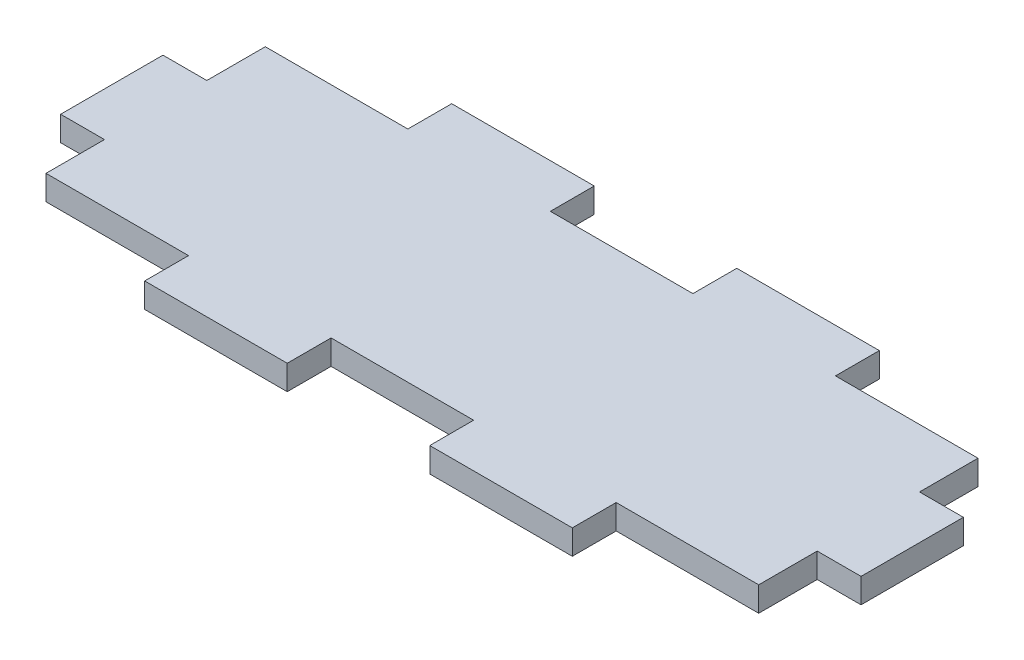
ISO-10303-21;
HEADER;
FILE_DESCRIPTION(('STEP AP214'),'2;1');
FILE_NAME('part.step','',(''),(''),'','','');
FILE_SCHEMA(('AUTOMOTIVE_DESIGN { 1 0 10303 214 1 1 1 1 }'));
ENDSEC;
DATA;
#1=APPLICATION_CONTEXT('core data for automotive mechanical design processes');
#2=APPLICATION_PROTOCOL_DEFINITION('international standard','automotive_design',2000,#1);
#3=PRODUCT_CONTEXT('',#1,'mechanical');
#4=PRODUCT('Part','Part','',(#3));
#5=PRODUCT_RELATED_PRODUCT_CATEGORY('part','',(#4));
#6=PRODUCT_DEFINITION_FORMATION('','',#4);
#7=PRODUCT_DEFINITION_CONTEXT('part definition',#1,'design');
#8=PRODUCT_DEFINITION('design','',#6,#7);
#9=PRODUCT_DEFINITION_SHAPE('','',#8);
#10=(LENGTH_UNIT() NAMED_UNIT(*) SI_UNIT(.MILLI.,.METRE.));
#11=(NAMED_UNIT(*) PLANE_ANGLE_UNIT() SI_UNIT($,.RADIAN.));
#12=(NAMED_UNIT(*) SI_UNIT($,.STERADIAN.) SOLID_ANGLE_UNIT());
#13=UNCERTAINTY_MEASURE_WITH_UNIT(LENGTH_MEASURE(1.E-05),#10,'distance_accuracy_value','');
#14=(GEOMETRIC_REPRESENTATION_CONTEXT(3) GLOBAL_UNCERTAINTY_ASSIGNED_CONTEXT((#13)) GLOBAL_UNIT_ASSIGNED_CONTEXT((#10,
#11,#12)) REPRESENTATION_CONTEXT('',''));
#15=CARTESIAN_POINT('',(0.,0.,0.));
#16=DIRECTION('',(0.,0.,1.));
#17=DIRECTION('',(1.,0.,0.));
#18=AXIS2_PLACEMENT_3D('',#15,#16,#17);
#19=CARTESIAN_POINT('',(0.,2.25,0.));
#20=DIRECTION('',(0.,0.,-1.));
#21=DIRECTION('',(-1.,0.,0.));
#22=AXIS2_PLACEMENT_3D('',#19,#20,#21);
#23=PLANE('',#22);
#24=DIRECTION('',(1.,0.,0.));
#25=VECTOR('',#24,1.);
#26=CARTESIAN_POINT('',(0.,0.,0.));
#27=LINE('',#26,#25);
#28=CARTESIAN_POINT('',(0.,0.,0.));
#29=VERTEX_POINT('',#28);
#30=CARTESIAN_POINT('',(13.,0.,0.));
#31=VERTEX_POINT('',#30);
#32=EDGE_CURVE('E259',#29,#31,#27,.T.);
#33=ORIENTED_EDGE('',*,*,#32,.T.);
#34=DIRECTION('',(0.,-1.,0.));
#35=VECTOR('',#34,1.);
#36=CARTESIAN_POINT('',(13.,2.25,0.));
#37=LINE('',#36,#35);
#38=CARTESIAN_POINT('',(13.,2.25,0.));
#39=VERTEX_POINT('',#38);
#40=EDGE_CURVE('E11',#39,#31,#37,.T.);
#41=ORIENTED_EDGE('',*,*,#40,.F.);
#42=DIRECTION('',(1.,0.,0.));
#43=VECTOR('',#42,1.);
#44=CARTESIAN_POINT('',(0.,2.25,0.));
#45=LINE('',#44,#43);
#46=CARTESIAN_POINT('',(0.,2.25,0.));
#47=VERTEX_POINT('',#46);
#48=EDGE_CURVE('E395',#47,#39,#45,.T.);
#49=ORIENTED_EDGE('',*,*,#48,.F.);
#50=DIRECTION('',(0.,-1.,0.));
#51=VECTOR('',#50,1.);
#52=CARTESIAN_POINT('',(0.,2.25,0.));
#53=LINE('',#52,#51);
#54=EDGE_CURVE('E56',#47,#29,#53,.T.);
#55=ORIENTED_EDGE('',*,*,#54,.T.);
#56=EDGE_LOOP('',(#33,#41,#49,#55));
#57=FACE_BOUND('',#56,.T.);
#58=ADVANCED_FACE('F39',(#57),#23,.F.);
#59=CARTESIAN_POINT('',(13.,2.25,0.));
#60=DIRECTION('',(1.,0.,0.));
#61=DIRECTION('',(0.,0.,-1.));
#62=AXIS2_PLACEMENT_3D('',#59,#60,#61);
#63=PLANE('',#62);
#64=DIRECTION('',(0.,0.,1.));
#65=VECTOR('',#64,1.);
#66=CARTESIAN_POINT('',(13.,0.,0.));
#67=LINE('',#66,#65);
#68=CARTESIAN_POINT('',(13.,0.,3.99999999999999));
#69=VERTEX_POINT('',#68);
#70=EDGE_CURVE('E261',#31,#69,#67,.T.);
#71=ORIENTED_EDGE('',*,*,#70,.T.);
#72=DIRECTION('',(0.,-1.,0.));
#73=VECTOR('',#72,1.);
#74=CARTESIAN_POINT('',(13.,2.25,3.99999999999999));
#75=LINE('',#74,#73);
#76=CARTESIAN_POINT('',(13.,2.25,3.99999999999999));
#77=VERTEX_POINT('',#76);
#78=EDGE_CURVE('E48',#77,#69,#75,.T.);
#79=ORIENTED_EDGE('',*,*,#78,.F.);
#80=DIRECTION('',(0.,0.,1.));
#81=VECTOR('',#80,1.);
#82=CARTESIAN_POINT('',(13.,2.25,0.));
#83=LINE('',#82,#81);
#84=EDGE_CURVE('E154',#39,#77,#83,.T.);
#85=ORIENTED_EDGE('',*,*,#84,.F.);
#86=ORIENTED_EDGE('',*,*,#40,.T.);
#87=EDGE_LOOP('',(#71,#79,#85,#86));
#88=FACE_BOUND('',#87,.T.);
#89=ADVANCED_FACE('F41',(#88),#63,.F.);
#90=CARTESIAN_POINT('',(0.,2.25,3.99999999999999));
#91=DIRECTION('',(0.,0.,-1.));
#92=DIRECTION('',(-1.,0.,0.));
#93=AXIS2_PLACEMENT_3D('',#90,#91,#92);
#94=PLANE('',#93);
#95=DIRECTION('',(1.,0.,0.));
#96=VECTOR('',#95,1.);
#97=CARTESIAN_POINT('',(0.,0.,3.99999999999999));
#98=LINE('',#97,#96);
#99=CARTESIAN_POINT('',(26.,0.,3.99999999999999));
#100=VERTEX_POINT('',#99);
#101=EDGE_CURVE('E265',#69,#100,#98,.T.);
#102=ORIENTED_EDGE('',*,*,#101,.T.);
#103=DIRECTION('',(0.,-1.,0.));
#104=VECTOR('',#103,1.);
#105=CARTESIAN_POINT('',(26.,2.25,3.99999999999999));
#106=LINE('',#105,#104);
#107=CARTESIAN_POINT('',(26.,2.25,3.99999999999999));
#108=VERTEX_POINT('',#107);
#109=EDGE_CURVE('E372',#108,#100,#106,.T.);
#110=ORIENTED_EDGE('',*,*,#109,.F.);
#111=DIRECTION('',(1.,0.,0.));
#112=VECTOR('',#111,1.);
#113=CARTESIAN_POINT('',(0.,2.25,3.99999999999999));
#114=LINE('',#113,#112);
#115=EDGE_CURVE('E379',#77,#108,#114,.T.);
#116=ORIENTED_EDGE('',*,*,#115,.F.);
#117=ORIENTED_EDGE('',*,*,#78,.T.);
#118=EDGE_LOOP('',(#102,#110,#116,#117));
#119=FACE_BOUND('',#118,.T.);
#120=ADVANCED_FACE('F377',(#119),#94,.F.);
#121=CARTESIAN_POINT('',(26.,2.25,0.));
#122=DIRECTION('',(1.,0.,0.));
#123=DIRECTION('',(0.,0.,-1.));
#124=AXIS2_PLACEMENT_3D('',#121,#122,#123);
#125=PLANE('',#124);
#126=DIRECTION('',(0.,0.,1.));
#127=VECTOR('',#126,1.);
#128=CARTESIAN_POINT('',(26.,0.,0.));
#129=LINE('',#128,#127);
#130=CARTESIAN_POINT('',(26.,0.,0.));
#131=VERTEX_POINT('',#130);
#132=EDGE_CURVE('E268',#131,#100,#129,.T.);
#133=ORIENTED_EDGE('',*,*,#132,.F.);
#134=DIRECTION('',(0.,-1.,0.));
#135=VECTOR('',#134,1.);
#136=CARTESIAN_POINT('',(26.,2.25,0.));
#137=LINE('',#136,#135);
#138=CARTESIAN_POINT('',(26.,2.25,0.));
#139=VERTEX_POINT('',#138);
#140=EDGE_CURVE('E370',#139,#131,#137,.T.);
#141=ORIENTED_EDGE('',*,*,#140,.F.);
#142=DIRECTION('',(0.,0.,1.));
#143=VECTOR('',#142,1.);
#144=CARTESIAN_POINT('',(26.,2.25,0.));
#145=LINE('',#144,#143);
#146=EDGE_CURVE('E390',#139,#108,#145,.T.);
#147=ORIENTED_EDGE('',*,*,#146,.T.);
#148=ORIENTED_EDGE('',*,*,#109,.T.);
#149=EDGE_LOOP('',(#133,#141,#147,#148));
#150=FACE_BOUND('',#149,.T.);
#151=ADVANCED_FACE('F386',(#150),#125,.T.);
#152=CARTESIAN_POINT('',(39.,0.,0.));
#153=VERTEX_POINT('',#152);
#154=EDGE_CURVE('E263',#131,#153,#27,.T.);
#155=ORIENTED_EDGE('',*,*,#154,.T.);
#156=DIRECTION('',(0.,-1.,0.));
#157=VECTOR('',#156,1.);
#158=CARTESIAN_POINT('',(39.,2.25,0.));
#159=LINE('',#158,#157);
#160=CARTESIAN_POINT('',(39.,2.25,0.));
#161=VERTEX_POINT('',#160);
#162=EDGE_CURVE('E367',#161,#153,#159,.T.);
#163=ORIENTED_EDGE('',*,*,#162,.F.);
#164=EDGE_CURVE('E391',#139,#161,#45,.T.);
#165=ORIENTED_EDGE('',*,*,#164,.F.);
#166=ORIENTED_EDGE('',*,*,#140,.T.);
#167=EDGE_LOOP('',(#155,#163,#165,#166));
#168=FACE_BOUND('',#167,.T.);
#169=ADVANCED_FACE('F484',(#168),#23,.F.);
#170=CARTESIAN_POINT('',(39.,2.25,0.));
#171=DIRECTION('',(1.,0.,0.));
#172=DIRECTION('',(0.,0.,-1.));
#173=AXIS2_PLACEMENT_3D('',#170,#171,#172);
#174=PLANE('',#173);
#175=DIRECTION('',(0.,0.,1.));
#176=VECTOR('',#175,1.);
#177=CARTESIAN_POINT('',(39.,0.,0.));
#178=LINE('',#177,#176);
#179=CARTESIAN_POINT('',(39.,0.,3.99999999999999));
#180=VERTEX_POINT('',#179);
#181=EDGE_CURVE('E271',#153,#180,#178,.T.);
#182=ORIENTED_EDGE('',*,*,#181,.T.);
#183=DIRECTION('',(0.,-1.,0.));
#184=VECTOR('',#183,1.);
#185=CARTESIAN_POINT('',(39.,2.25,3.99999999999999));
#186=LINE('',#185,#184);
#187=CARTESIAN_POINT('',(39.,2.25,3.99999999999999));
#188=VERTEX_POINT('',#187);
#189=EDGE_CURVE('E364',#188,#180,#186,.T.);
#190=ORIENTED_EDGE('',*,*,#189,.F.);
#191=DIRECTION('',(0.,0.,1.));
#192=VECTOR('',#191,1.);
#193=CARTESIAN_POINT('',(39.,2.25,0.));
#194=LINE('',#193,#192);
#195=EDGE_CURVE('E393',#161,#188,#194,.T.);
#196=ORIENTED_EDGE('',*,*,#195,.F.);
#197=ORIENTED_EDGE('',*,*,#162,.T.);
#198=EDGE_LOOP('',(#182,#190,#196,#197));
#199=FACE_BOUND('',#198,.T.);
#200=ADVANCED_FACE('F492',(#199),#174,.F.);
#201=CARTESIAN_POINT('',(0.,2.25,4.));
#202=DIRECTION('',(0.,0.,-1.));
#203=DIRECTION('',(-1.,0.,0.));
#204=AXIS2_PLACEMENT_3D('',#201,#202,#203);
#205=PLANE('',#204);
#206=DIRECTION('',(1.,0.,0.));
#207=VECTOR('',#206,1.);
#208=CARTESIAN_POINT('',(0.,0.,4.));
#209=LINE('',#208,#207);
#210=CARTESIAN_POINT('',(52.,0.,3.99999999999999));
#211=VERTEX_POINT('',#210);
#212=EDGE_CURVE('E273',#180,#211,#209,.T.);
#213=ORIENTED_EDGE('',*,*,#212,.T.);
#214=DIRECTION('',(0.,-1.,0.));
#215=VECTOR('',#214,1.);
#216=CARTESIAN_POINT('',(52.,2.25,3.99999999999999));
#217=LINE('',#216,#215);
#218=CARTESIAN_POINT('',(52.,2.25,3.99999999999999));
#219=VERTEX_POINT('',#218);
#220=EDGE_CURVE('E362',#219,#211,#217,.T.);
#221=ORIENTED_EDGE('',*,*,#220,.F.);
#222=DIRECTION('',(1.,0.,0.));
#223=VECTOR('',#222,1.);
#224=CARTESIAN_POINT('',(0.,2.25,4.));
#225=LINE('',#224,#223);
#226=EDGE_CURVE('E401',#188,#219,#225,.T.);
#227=ORIENTED_EDGE('',*,*,#226,.F.);
#228=ORIENTED_EDGE('',*,*,#189,.T.);
#229=EDGE_LOOP('',(#213,#221,#227,#228));
#230=FACE_BOUND('',#229,.T.);
#231=ADVANCED_FACE('F506',(#230),#205,.F.);
#232=CARTESIAN_POINT('',(52.,2.25,0.));
#233=DIRECTION('',(1.,0.,0.));
#234=DIRECTION('',(0.,0.,-1.));
#235=AXIS2_PLACEMENT_3D('',#232,#233,#234);
#236=PLANE('',#235);
#237=DIRECTION('',(0.,0.,1.));
#238=VECTOR('',#237,1.);
#239=CARTESIAN_POINT('',(52.,0.,0.));
#240=LINE('',#239,#238);
#241=CARTESIAN_POINT('',(52.,0.,0.));
#242=VERTEX_POINT('',#241);
#243=EDGE_CURVE('E276',#242,#211,#240,.T.);
#244=ORIENTED_EDGE('',*,*,#243,.F.);
#245=DIRECTION('',(0.,-1.,0.));
#246=VECTOR('',#245,1.);
#247=CARTESIAN_POINT('',(52.,2.25,0.));
#248=LINE('',#247,#246);
#249=CARTESIAN_POINT('',(52.,2.25,0.));
#250=VERTEX_POINT('',#249);
#251=EDGE_CURVE('E360',#250,#242,#248,.T.);
#252=ORIENTED_EDGE('',*,*,#251,.F.);
#253=DIRECTION('',(0.,0.,1.));
#254=VECTOR('',#253,1.);
#255=CARTESIAN_POINT('',(52.,2.25,0.));
#256=LINE('',#255,#254);
#257=EDGE_CURVE('E403',#250,#219,#256,.T.);
#258=ORIENTED_EDGE('',*,*,#257,.T.);
#259=ORIENTED_EDGE('',*,*,#220,.T.);
#260=EDGE_LOOP('',(#244,#252,#258,#259));
#261=FACE_BOUND('',#260,.T.);
#262=ADVANCED_FACE('F496',(#261),#236,.T.);
#263=CARTESIAN_POINT('',(65.,0.,0.));
#264=VERTEX_POINT('',#263);
#265=EDGE_CURVE('E262',#242,#264,#27,.T.);
#266=ORIENTED_EDGE('',*,*,#265,.T.);
#267=DIRECTION('',(0.,-1.,0.));
#268=VECTOR('',#267,1.);
#269=CARTESIAN_POINT('',(65.,2.25,0.));
#270=LINE('',#269,#268);
#271=CARTESIAN_POINT('',(65.,2.25,0.));
#272=VERTEX_POINT('',#271);
#273=EDGE_CURVE('E357',#272,#264,#270,.T.);
#274=ORIENTED_EDGE('',*,*,#273,.F.);
#275=EDGE_CURVE('E396',#250,#272,#45,.T.);
#276=ORIENTED_EDGE('',*,*,#275,.F.);
#277=ORIENTED_EDGE('',*,*,#251,.T.);
#278=EDGE_LOOP('',(#266,#274,#276,#277));
#279=FACE_BOUND('',#278,.T.);
#280=ADVANCED_FACE('F485',(#279),#23,.F.);
#281=CARTESIAN_POINT('',(65.,2.25,0.));
#282=DIRECTION('',(-1.,0.,0.));
#283=DIRECTION('',(0.,0.,1.));
#284=AXIS2_PLACEMENT_3D('',#281,#282,#283);
#285=PLANE('',#284);
#286=DIRECTION('',(0.,0.,-1.));
#287=VECTOR('',#286,1.);
#288=CARTESIAN_POINT('',(65.,0.,0.));
#289=LINE('',#288,#287);
#290=CARTESIAN_POINT('',(65.,0.,-5.33333333333334));
#291=VERTEX_POINT('',#290);
#292=EDGE_CURVE('E279',#264,#291,#289,.T.);
#293=ORIENTED_EDGE('',*,*,#292,.T.);
#294=DIRECTION('',(0.,-1.,0.));
#295=VECTOR('',#294,1.);
#296=CARTESIAN_POINT('',(65.,2.25,-5.33333333333334));
#297=LINE('',#296,#295);
#298=CARTESIAN_POINT('',(65.,2.25,-5.33333333333334));
#299=VERTEX_POINT('',#298);
#300=EDGE_CURVE('E354',#299,#291,#297,.T.);
#301=ORIENTED_EDGE('',*,*,#300,.F.);
#302=DIRECTION('',(0.,0.,-1.));
#303=VECTOR('',#302,1.);
#304=CARTESIAN_POINT('',(65.,2.25,0.));
#305=LINE('',#304,#303);
#306=EDGE_CURVE('E406',#272,#299,#305,.T.);
#307=ORIENTED_EDGE('',*,*,#306,.F.);
#308=ORIENTED_EDGE('',*,*,#273,.T.);
#309=EDGE_LOOP('',(#293,#301,#307,#308));
#310=FACE_BOUND('',#309,.T.);
#311=ADVANCED_FACE('F495',(#310),#285,.F.);
#312=CARTESIAN_POINT('',(0.,2.25,-5.33333333333336));
#313=DIRECTION('',(0.,0.,-1.));
#314=DIRECTION('',(-1.,0.,0.));
#315=AXIS2_PLACEMENT_3D('',#312,#313,#314);
#316=PLANE('',#315);
#317=DIRECTION('',(1.,0.,0.));
#318=VECTOR('',#317,1.);
#319=CARTESIAN_POINT('',(0.,0.,-5.33333333333336));
#320=LINE('',#319,#318);
#321=CARTESIAN_POINT('',(69.,0.,-5.33333333333333));
#322=VERTEX_POINT('',#321);
#323=EDGE_CURVE('E281',#291,#322,#320,.T.);
#324=ORIENTED_EDGE('',*,*,#323,.T.);
#325=DIRECTION('',(0.,-1.,0.));
#326=VECTOR('',#325,1.);
#327=CARTESIAN_POINT('',(69.,2.25,-5.33333333333333));
#328=LINE('',#327,#326);
#329=CARTESIAN_POINT('',(69.,2.25,-5.33333333333333));
#330=VERTEX_POINT('',#329);
#331=EDGE_CURVE('E352',#330,#322,#328,.T.);
#332=ORIENTED_EDGE('',*,*,#331,.F.);
#333=DIRECTION('',(1.,0.,0.));
#334=VECTOR('',#333,1.);
#335=CARTESIAN_POINT('',(0.,2.25,-5.33333333333336));
#336=LINE('',#335,#334);
#337=EDGE_CURVE('E408',#299,#330,#336,.T.);
#338=ORIENTED_EDGE('',*,*,#337,.F.);
#339=ORIENTED_EDGE('',*,*,#300,.T.);
#340=EDGE_LOOP('',(#324,#332,#338,#339));
#341=FACE_BOUND('',#340,.T.);
#342=ADVANCED_FACE('F502',(#341),#316,.F.);
#343=CARTESIAN_POINT('',(69.,2.25,0.));
#344=DIRECTION('',(1.,0.,0.));
#345=DIRECTION('',(0.,0.,-1.));
#346=AXIS2_PLACEMENT_3D('',#343,#344,#345);
#347=PLANE('',#346);
#348=DIRECTION('',(0.,0.,1.));
#349=VECTOR('',#348,1.);
#350=CARTESIAN_POINT('',(69.,0.,0.));
#351=LINE('',#350,#349);
#352=CARTESIAN_POINT('',(69.,0.,-14.6666666666667));
#353=VERTEX_POINT('',#352);
#354=EDGE_CURVE('E285',#353,#322,#351,.T.);
#355=ORIENTED_EDGE('',*,*,#354,.F.);
#356=DIRECTION('',(0.,-1.,0.));
#357=VECTOR('',#356,1.);
#358=CARTESIAN_POINT('',(69.,2.25,-14.6666666666667));
#359=LINE('',#358,#357);
#360=CARTESIAN_POINT('',(69.,2.25,-14.6666666666667));
#361=VERTEX_POINT('',#360);
#362=EDGE_CURVE('E350',#361,#353,#359,.T.);
#363=ORIENTED_EDGE('',*,*,#362,.F.);
#364=DIRECTION('',(0.,0.,1.));
#365=VECTOR('',#364,1.);
#366=CARTESIAN_POINT('',(69.,2.25,0.));
#367=LINE('',#366,#365);
#368=EDGE_CURVE('E411',#361,#330,#367,.T.);
#369=ORIENTED_EDGE('',*,*,#368,.T.);
#370=ORIENTED_EDGE('',*,*,#331,.T.);
#371=EDGE_LOOP('',(#355,#363,#369,#370));
#372=FACE_BOUND('',#371,.T.);
#373=ADVANCED_FACE('F572',(#372),#347,.T.);
#374=CARTESIAN_POINT('',(0.,2.25,-14.6666666666667));
#375=DIRECTION('',(0.,0.,-1.));
#376=DIRECTION('',(-1.,0.,0.));
#377=AXIS2_PLACEMENT_3D('',#374,#375,#376);
#378=PLANE('',#377);
#379=DIRECTION('',(1.,0.,0.));
#380=VECTOR('',#379,1.);
#381=CARTESIAN_POINT('',(0.,0.,-14.6666666666667));
#382=LINE('',#381,#380);
#383=CARTESIAN_POINT('',(65.,0.,-14.6666666666667));
#384=VERTEX_POINT('',#383);
#385=EDGE_CURVE('E288',#384,#353,#382,.T.);
#386=ORIENTED_EDGE('',*,*,#385,.F.);
#387=DIRECTION('',(0.,-1.,0.));
#388=VECTOR('',#387,1.);
#389=CARTESIAN_POINT('',(65.,2.25,-14.6666666666667));
#390=LINE('',#389,#388);
#391=CARTESIAN_POINT('',(65.,2.25,-14.6666666666667));
#392=VERTEX_POINT('',#391);
#393=EDGE_CURVE('E348',#392,#384,#390,.T.);
#394=ORIENTED_EDGE('',*,*,#393,.F.);
#395=DIRECTION('',(1.,0.,0.));
#396=VECTOR('',#395,1.);
#397=CARTESIAN_POINT('',(0.,2.25,-14.6666666666667));
#398=LINE('',#397,#396);
#399=EDGE_CURVE('E414',#392,#361,#398,.T.);
#400=ORIENTED_EDGE('',*,*,#399,.T.);
#401=ORIENTED_EDGE('',*,*,#362,.T.);
#402=EDGE_LOOP('',(#386,#394,#400,#401));
#403=FACE_BOUND('',#402,.T.);
#404=ADVANCED_FACE('F558',(#403),#378,.T.);
#405=CARTESIAN_POINT('',(65.,0.,-20.));
#406=VERTEX_POINT('',#405);
#407=EDGE_CURVE('E282',#384,#406,#289,.T.);
#408=ORIENTED_EDGE('',*,*,#407,.T.);
#409=DIRECTION('',(0.,-1.,0.));
#410=VECTOR('',#409,1.);
#411=CARTESIAN_POINT('',(65.,2.25,-20.));
#412=LINE('',#411,#410);
#413=CARTESIAN_POINT('',(65.,2.25,-20.));
#414=VERTEX_POINT('',#413);
#415=EDGE_CURVE('E346',#414,#406,#412,.T.);
#416=ORIENTED_EDGE('',*,*,#415,.F.);
#417=EDGE_CURVE('E409',#392,#414,#305,.T.);
#418=ORIENTED_EDGE('',*,*,#417,.F.);
#419=ORIENTED_EDGE('',*,*,#393,.T.);
#420=EDGE_LOOP('',(#408,#416,#418,#419));
#421=FACE_BOUND('',#420,.T.);
#422=ADVANCED_FACE('F505',(#421),#285,.F.);
#423=CARTESIAN_POINT('',(0.,2.25,-20.));
#424=DIRECTION('',(0.,0.,-1.));
#425=DIRECTION('',(-1.,0.,0.));
#426=AXIS2_PLACEMENT_3D('',#423,#424,#425);
#427=PLANE('',#426);
#428=DIRECTION('',(1.,0.,0.));
#429=VECTOR('',#428,1.);
#430=CARTESIAN_POINT('',(0.,0.,-20.));
#431=LINE('',#430,#429);
#432=CARTESIAN_POINT('',(52.,0.,-20.));
#433=VERTEX_POINT('',#432);
#434=EDGE_CURVE('E291',#433,#406,#431,.T.);
#435=ORIENTED_EDGE('',*,*,#434,.F.);
#436=DIRECTION('',(0.,-1.,0.));
#437=VECTOR('',#436,1.);
#438=CARTESIAN_POINT('',(52.,2.25,-20.));
#439=LINE('',#438,#437);
#440=CARTESIAN_POINT('',(52.,2.25,-20.));
#441=VERTEX_POINT('',#440);
#442=EDGE_CURVE('E344',#441,#433,#439,.T.);
#443=ORIENTED_EDGE('',*,*,#442,.F.);
#444=DIRECTION('',(1.,0.,0.));
#445=VECTOR('',#444,1.);
#446=CARTESIAN_POINT('',(0.,2.25,-20.));
#447=LINE('',#446,#445);
#448=EDGE_CURVE('E417',#441,#414,#447,.T.);
#449=ORIENTED_EDGE('',*,*,#448,.T.);
#450=ORIENTED_EDGE('',*,*,#415,.T.);
#451=EDGE_LOOP('',(#435,#443,#449,#450));
#452=FACE_BOUND('',#451,.T.);
#453=ADVANCED_FACE('F480',(#452),#427,.T.);
#454=CARTESIAN_POINT('',(52.,2.25,0.));
#455=DIRECTION('',(-1.,0.,0.));
#456=DIRECTION('',(0.,0.,1.));
#457=AXIS2_PLACEMENT_3D('',#454,#455,#456);
#458=PLANE('',#457);
#459=DIRECTION('',(0.,0.,-1.));
#460=VECTOR('',#459,1.);
#461=CARTESIAN_POINT('',(52.,0.,0.));
#462=LINE('',#461,#460);
#463=CARTESIAN_POINT('',(52.,0.,-24.));
#464=VERTEX_POINT('',#463);
#465=EDGE_CURVE('E294',#433,#464,#462,.T.);
#466=ORIENTED_EDGE('',*,*,#465,.T.);
#467=DIRECTION('',(0.,-1.,0.));
#468=VECTOR('',#467,1.);
#469=CARTESIAN_POINT('',(52.,2.25,-24.));
#470=LINE('',#469,#468);
#471=CARTESIAN_POINT('',(52.,2.25,-24.));
#472=VERTEX_POINT('',#471);
#473=EDGE_CURVE('E342',#472,#464,#470,.T.);
#474=ORIENTED_EDGE('',*,*,#473,.F.);
#475=DIRECTION('',(0.,0.,-1.));
#476=VECTOR('',#475,1.);
#477=CARTESIAN_POINT('',(52.,2.25,0.));
#478=LINE('',#477,#476);
#479=EDGE_CURVE('E420',#441,#472,#478,.T.);
#480=ORIENTED_EDGE('',*,*,#479,.F.);
#481=ORIENTED_EDGE('',*,*,#442,.T.);
#482=EDGE_LOOP('',(#466,#474,#480,#481));
#483=FACE_BOUND('',#482,.T.);
#484=ADVANCED_FACE('F549',(#483),#458,.F.);
#485=CARTESIAN_POINT('',(0.,2.25,-24.));
#486=DIRECTION('',(0.,0.,-1.));
#487=DIRECTION('',(-1.,0.,0.));
#488=AXIS2_PLACEMENT_3D('',#485,#486,#487);
#489=PLANE('',#488);
#490=DIRECTION('',(1.,0.,0.));
#491=VECTOR('',#490,1.);
#492=CARTESIAN_POINT('',(0.,0.,-24.));
#493=LINE('',#492,#491);
#494=CARTESIAN_POINT('',(39.,0.,-24.));
#495=VERTEX_POINT('',#494);
#496=EDGE_CURVE('E299',#495,#464,#493,.T.);
#497=ORIENTED_EDGE('',*,*,#496,.F.);
#498=DIRECTION('',(0.,-1.,0.));
#499=VECTOR('',#498,1.);
#500=CARTESIAN_POINT('',(39.,2.25,-24.));
#501=LINE('',#500,#499);
#502=CARTESIAN_POINT('',(39.,2.25,-24.));
#503=VERTEX_POINT('',#502);
#504=EDGE_CURVE('E340',#503,#495,#501,.T.);
#505=ORIENTED_EDGE('',*,*,#504,.F.);
#506=DIRECTION('',(1.,0.,0.));
#507=VECTOR('',#506,1.);
#508=CARTESIAN_POINT('',(0.,2.25,-24.));
#509=LINE('',#508,#507);
#510=EDGE_CURVE('E424',#503,#472,#509,.T.);
#511=ORIENTED_EDGE('',*,*,#510,.T.);
#512=ORIENTED_EDGE('',*,*,#473,.T.);
#513=EDGE_LOOP('',(#497,#505,#511,#512));
#514=FACE_BOUND('',#513,.T.);
#515=ADVANCED_FACE('F555',(#514),#489,.T.);
#516=CARTESIAN_POINT('',(39.,2.25,0.));
#517=DIRECTION('',(-1.,0.,0.));
#518=DIRECTION('',(0.,0.,1.));
#519=AXIS2_PLACEMENT_3D('',#516,#517,#518);
#520=PLANE('',#519);
#521=DIRECTION('',(0.,0.,-1.));
#522=VECTOR('',#521,1.);
#523=CARTESIAN_POINT('',(39.,0.,0.));
#524=LINE('',#523,#522);
#525=CARTESIAN_POINT('',(39.,0.,-20.));
#526=VERTEX_POINT('',#525);
#527=EDGE_CURVE('E302',#526,#495,#524,.T.);
#528=ORIENTED_EDGE('',*,*,#527,.F.);
#529=DIRECTION('',(0.,-1.,0.));
#530=VECTOR('',#529,1.);
#531=CARTESIAN_POINT('',(39.,2.25,-20.));
#532=LINE('',#531,#530);
#533=CARTESIAN_POINT('',(39.,2.25,-20.));
#534=VERTEX_POINT('',#533);
#535=EDGE_CURVE('E338',#534,#526,#532,.T.);
#536=ORIENTED_EDGE('',*,*,#535,.F.);
#537=DIRECTION('',(0.,0.,-1.));
#538=VECTOR('',#537,1.);
#539=CARTESIAN_POINT('',(39.,2.25,0.));
#540=LINE('',#539,#538);
#541=EDGE_CURVE('E427',#534,#503,#540,.T.);
#542=ORIENTED_EDGE('',*,*,#541,.T.);
#543=ORIENTED_EDGE('',*,*,#504,.T.);
#544=EDGE_LOOP('',(#528,#536,#542,#543));
#545=FACE_BOUND('',#544,.T.);
#546=ADVANCED_FACE('F454',(#545),#520,.T.);
#547=CARTESIAN_POINT('',(26.,0.,-20.));
#548=VERTEX_POINT('',#547);
#549=EDGE_CURVE('E296',#548,#526,#431,.T.);
#550=ORIENTED_EDGE('',*,*,#549,.F.);
#551=DIRECTION('',(0.,-1.,0.));
#552=VECTOR('',#551,1.);
#553=CARTESIAN_POINT('',(26.,2.25,-20.));
#554=LINE('',#553,#552);
#555=CARTESIAN_POINT('',(26.,2.25,-20.));
#556=VERTEX_POINT('',#555);
#557=EDGE_CURVE('E336',#556,#548,#554,.T.);
#558=ORIENTED_EDGE('',*,*,#557,.F.);
#559=EDGE_CURVE('E422',#556,#534,#447,.T.);
#560=ORIENTED_EDGE('',*,*,#559,.T.);
#561=ORIENTED_EDGE('',*,*,#535,.T.);
#562=EDGE_LOOP('',(#550,#558,#560,#561));
#563=FACE_BOUND('',#562,.T.);
#564=ADVANCED_FACE('F446',(#563),#427,.T.);
#565=CARTESIAN_POINT('',(26.,2.25,0.));
#566=DIRECTION('',(-1.,0.,0.));
#567=DIRECTION('',(0.,0.,1.));
#568=AXIS2_PLACEMENT_3D('',#565,#566,#567);
#569=PLANE('',#568);
#570=DIRECTION('',(0.,0.,-1.));
#571=VECTOR('',#570,1.);
#572=CARTESIAN_POINT('',(26.,0.,0.));
#573=LINE('',#572,#571);
#574=CARTESIAN_POINT('',(26.,0.,-24.));
#575=VERTEX_POINT('',#574);
#576=EDGE_CURVE('E305',#548,#575,#573,.T.);
#577=ORIENTED_EDGE('',*,*,#576,.T.);
#578=DIRECTION('',(0.,-1.,0.));
#579=VECTOR('',#578,1.);
#580=CARTESIAN_POINT('',(26.,2.25,-24.));
#581=LINE('',#580,#579);
#582=CARTESIAN_POINT('',(26.,2.25,-24.));
#583=VERTEX_POINT('',#582);
#584=EDGE_CURVE('E334',#583,#575,#581,.T.);
#585=ORIENTED_EDGE('',*,*,#584,.F.);
#586=DIRECTION('',(0.,0.,-1.));
#587=VECTOR('',#586,1.);
#588=CARTESIAN_POINT('',(26.,2.25,0.));
#589=LINE('',#588,#587);
#590=EDGE_CURVE('E430',#556,#583,#589,.T.);
#591=ORIENTED_EDGE('',*,*,#590,.F.);
#592=ORIENTED_EDGE('',*,*,#557,.T.);
#593=EDGE_LOOP('',(#577,#585,#591,#592));
#594=FACE_BOUND('',#593,.T.);
#595=ADVANCED_FACE('F471',(#594),#569,.F.);
#596=CARTESIAN_POINT('',(0.,2.25,-24.));
#597=DIRECTION('',(0.,0.,-1.));
#598=DIRECTION('',(-1.,0.,0.));
#599=AXIS2_PLACEMENT_3D('',#596,#597,#598);
#600=PLANE('',#599);
#601=DIRECTION('',(1.,0.,0.));
#602=VECTOR('',#601,1.);
#603=CARTESIAN_POINT('',(0.,0.,-24.));
#604=LINE('',#603,#602);
#605=CARTESIAN_POINT('',(13.,0.,-24.));
#606=VERTEX_POINT('',#605);
#607=EDGE_CURVE('E308',#606,#575,#604,.T.);
#608=ORIENTED_EDGE('',*,*,#607,.F.);
#609=DIRECTION('',(0.,-1.,0.));
#610=VECTOR('',#609,1.);
#611=CARTESIAN_POINT('',(13.,2.25,-24.));
#612=LINE('',#611,#610);
#613=CARTESIAN_POINT('',(13.,2.25,-24.));
#614=VERTEX_POINT('',#613);
#615=EDGE_CURVE('E332',#614,#606,#612,.T.);
#616=ORIENTED_EDGE('',*,*,#615,.F.);
#617=DIRECTION('',(1.,0.,0.));
#618=VECTOR('',#617,1.);
#619=CARTESIAN_POINT('',(0.,2.25,-24.));
#620=LINE('',#619,#618);
#621=EDGE_CURVE('E432',#614,#583,#620,.T.);
#622=ORIENTED_EDGE('',*,*,#621,.T.);
#623=ORIENTED_EDGE('',*,*,#584,.T.);
#624=EDGE_LOOP('',(#608,#616,#622,#623));
#625=FACE_BOUND('',#624,.T.);
#626=ADVANCED_FACE('F469',(#625),#600,.T.);
#627=CARTESIAN_POINT('',(13.,2.25,0.));
#628=DIRECTION('',(-1.,0.,0.));
#629=DIRECTION('',(0.,0.,1.));
#630=AXIS2_PLACEMENT_3D('',#627,#628,#629);
#631=PLANE('',#630);
#632=DIRECTION('',(0.,0.,-1.));
#633=VECTOR('',#632,1.);
#634=CARTESIAN_POINT('',(13.,0.,0.));
#635=LINE('',#634,#633);
#636=CARTESIAN_POINT('',(13.,0.,-20.));
#637=VERTEX_POINT('',#636);
#638=EDGE_CURVE('E311',#637,#606,#635,.T.);
#639=ORIENTED_EDGE('',*,*,#638,.F.);
#640=DIRECTION('',(0.,-1.,0.));
#641=VECTOR('',#640,1.);
#642=CARTESIAN_POINT('',(13.,2.25,-20.));
#643=LINE('',#642,#641);
#644=CARTESIAN_POINT('',(13.,2.25,-20.));
#645=VERTEX_POINT('',#644);
#646=EDGE_CURVE('E330',#645,#637,#643,.T.);
#647=ORIENTED_EDGE('',*,*,#646,.F.);
#648=DIRECTION('',(0.,0.,-1.));
#649=VECTOR('',#648,1.);
#650=CARTESIAN_POINT('',(13.,2.25,0.));
#651=LINE('',#650,#649);
#652=EDGE_CURVE('E435',#645,#614,#651,.T.);
#653=ORIENTED_EDGE('',*,*,#652,.T.);
#654=ORIENTED_EDGE('',*,*,#615,.T.);
#655=EDGE_LOOP('',(#639,#647,#653,#654));
#656=FACE_BOUND('',#655,.T.);
#657=ADVANCED_FACE('F466',(#656),#631,.T.);
#658=CARTESIAN_POINT('',(0.,0.,-20.));
#659=VERTEX_POINT('',#658);
#660=EDGE_CURVE('E295',#659,#637,#431,.T.);
#661=ORIENTED_EDGE('',*,*,#660,.F.);
#662=DIRECTION('',(0.,-1.,0.));
#663=VECTOR('',#662,1.);
#664=CARTESIAN_POINT('',(0.,2.25,-20.));
#665=LINE('',#664,#663);
#666=CARTESIAN_POINT('',(0.,2.25,-20.));
#667=VERTEX_POINT('',#666);
#668=EDGE_CURVE('E328',#667,#659,#665,.T.);
#669=ORIENTED_EDGE('',*,*,#668,.F.);
#670=EDGE_CURVE('E421',#667,#645,#447,.T.);
#671=ORIENTED_EDGE('',*,*,#670,.T.);
#672=ORIENTED_EDGE('',*,*,#646,.T.);
#673=EDGE_LOOP('',(#661,#669,#671,#672));
#674=FACE_BOUND('',#673,.T.);
#675=ADVANCED_FACE('F463',(#674),#427,.T.);
#676=CARTESIAN_POINT('',(0.,2.25,0.));
#677=DIRECTION('',(-1.,0.,0.));
#678=DIRECTION('',(0.,0.,1.));
#679=AXIS2_PLACEMENT_3D('',#676,#677,#678);
#680=PLANE('',#679);
#681=DIRECTION('',(0.,0.,-1.));
#682=VECTOR('',#681,1.);
#683=CARTESIAN_POINT('',(0.,0.,0.));
#684=LINE('',#683,#682);
#685=CARTESIAN_POINT('',(0.,0.,-14.6666666666667));
#686=VERTEX_POINT('',#685);
#687=EDGE_CURVE('E314',#686,#659,#684,.T.);
#688=ORIENTED_EDGE('',*,*,#687,.F.);
#689=DIRECTION('',(0.,-1.,0.));
#690=VECTOR('',#689,1.);
#691=CARTESIAN_POINT('',(0.,2.25,-14.6666666666667));
#692=LINE('',#691,#690);
#693=CARTESIAN_POINT('',(0.,2.25,-14.6666666666667));
#694=VERTEX_POINT('',#693);
#695=EDGE_CURVE('E326',#694,#686,#692,.T.);
#696=ORIENTED_EDGE('',*,*,#695,.F.);
#697=DIRECTION('',(0.,0.,-1.));
#698=VECTOR('',#697,1.);
#699=CARTESIAN_POINT('',(0.,2.25,0.));
#700=LINE('',#699,#698);
#701=EDGE_CURVE('E256',#694,#667,#700,.T.);
#702=ORIENTED_EDGE('',*,*,#701,.T.);
#703=ORIENTED_EDGE('',*,*,#668,.T.);
#704=EDGE_LOOP('',(#688,#696,#702,#703));
#705=FACE_BOUND('',#704,.T.);
#706=ADVANCED_FACE('F528',(#705),#680,.T.);
#707=CARTESIAN_POINT('',(0.,2.25,-14.6666666666667));
#708=DIRECTION('',(0.,0.,1.));
#709=DIRECTION('',(1.,0.,0.));
#710=AXIS2_PLACEMENT_3D('',#707,#708,#709);
#711=PLANE('',#710);
#712=DIRECTION('',(-1.,0.,0.));
#713=VECTOR('',#712,1.);
#714=CARTESIAN_POINT('',(0.,0.,-14.6666666666667));
#715=LINE('',#714,#713);
#716=CARTESIAN_POINT('',(-4.,0.,-14.6666666666667));
#717=VERTEX_POINT('',#716);
#718=EDGE_CURVE('E317',#686,#717,#715,.T.);
#719=ORIENTED_EDGE('',*,*,#718,.T.);
#720=DIRECTION('',(0.,-1.,0.));
#721=VECTOR('',#720,1.);
#722=CARTESIAN_POINT('',(-4.,2.25,-14.6666666666667));
#723=LINE('',#722,#721);
#724=CARTESIAN_POINT('',(-4.,2.25,-14.6666666666667));
#725=VERTEX_POINT('',#724);
#726=EDGE_CURVE('E250',#725,#717,#723,.T.);
#727=ORIENTED_EDGE('',*,*,#726,.F.);
#728=DIRECTION('',(-1.,0.,0.));
#729=VECTOR('',#728,1.);
#730=CARTESIAN_POINT('',(0.,2.25,-14.6666666666667));
#731=LINE('',#730,#729);
#732=EDGE_CURVE('E238',#694,#725,#731,.T.);
#733=ORIENTED_EDGE('',*,*,#732,.F.);
#734=ORIENTED_EDGE('',*,*,#695,.T.);
#735=EDGE_LOOP('',(#719,#727,#733,#734));
#736=FACE_BOUND('',#735,.T.);
#737=ADVANCED_FACE('F537',(#736),#711,.F.);
#738=CARTESIAN_POINT('',(-4.,2.25,0.));
#739=DIRECTION('',(1.,0.,0.));
#740=DIRECTION('',(0.,0.,-1.));
#741=AXIS2_PLACEMENT_3D('',#738,#739,#740);
#742=PLANE('',#741);
#743=DIRECTION('',(0.,0.,1.));
#744=VECTOR('',#743,1.);
#745=CARTESIAN_POINT('',(-4.,0.,0.));
#746=LINE('',#745,#744);
#747=CARTESIAN_POINT('',(-4.,0.,-5.33333333333334));
#748=VERTEX_POINT('',#747);
#749=EDGE_CURVE('E247',#717,#748,#746,.T.);
#750=ORIENTED_EDGE('',*,*,#749,.T.);
#751=DIRECTION('',(0.,-1.,0.));
#752=VECTOR('',#751,1.);
#753=CARTESIAN_POINT('',(-4.,2.25,-5.33333333333334));
#754=LINE('',#753,#752);
#755=CARTESIAN_POINT('',(-4.,2.25,-5.33333333333334));
#756=VERTEX_POINT('',#755);
#757=EDGE_CURVE('E244',#756,#748,#754,.T.);
#758=ORIENTED_EDGE('',*,*,#757,.F.);
#759=DIRECTION('',(0.,0.,1.));
#760=VECTOR('',#759,1.);
#761=CARTESIAN_POINT('',(-4.,2.25,0.));
#762=LINE('',#761,#760);
#763=EDGE_CURVE('E230',#725,#756,#762,.T.);
#764=ORIENTED_EDGE('',*,*,#763,.F.);
#765=ORIENTED_EDGE('',*,*,#726,.T.);
#766=EDGE_LOOP('',(#750,#758,#764,#765));
#767=FACE_BOUND('',#766,.T.);
#768=ADVANCED_FACE('F245',(#767),#742,.F.);
#769=CARTESIAN_POINT('',(0.,2.25,-5.33333333333334));
#770=DIRECTION('',(0.,0.,1.));
#771=DIRECTION('',(1.,0.,0.));
#772=AXIS2_PLACEMENT_3D('',#769,#770,#771);
#773=PLANE('',#772);
#774=DIRECTION('',(-1.,0.,0.));
#775=VECTOR('',#774,1.);
#776=CARTESIAN_POINT('',(0.,0.,-5.33333333333334));
#777=LINE('',#776,#775);
#778=CARTESIAN_POINT('',(0.,0.,-5.33333333333334));
#779=VERTEX_POINT('',#778);
#780=EDGE_CURVE('E321',#779,#748,#777,.T.);
#781=ORIENTED_EDGE('',*,*,#780,.F.);
#782=DIRECTION('',(0.,-1.,0.));
#783=VECTOR('',#782,1.);
#784=CARTESIAN_POINT('',(0.,2.25,-5.33333333333334));
#785=LINE('',#784,#783);
#786=CARTESIAN_POINT('',(0.,2.25,-5.33333333333334));
#787=VERTEX_POINT('',#786);
#788=EDGE_CURVE('E142',#787,#779,#785,.T.);
#789=ORIENTED_EDGE('',*,*,#788,.F.);
#790=DIRECTION('',(-1.,0.,0.));
#791=VECTOR('',#790,1.);
#792=CARTESIAN_POINT('',(0.,2.25,-5.33333333333334));
#793=LINE('',#792,#791);
#794=EDGE_CURVE('E235',#787,#756,#793,.T.);
#795=ORIENTED_EDGE('',*,*,#794,.T.);
#796=ORIENTED_EDGE('',*,*,#757,.T.);
#797=EDGE_LOOP('',(#781,#789,#795,#796));
#798=FACE_BOUND('',#797,.T.);
#799=ADVANCED_FACE('F252',(#798),#773,.T.);
#800=EDGE_CURVE('E318',#29,#779,#684,.T.);
#801=ORIENTED_EDGE('',*,*,#800,.F.);
#802=ORIENTED_EDGE('',*,*,#54,.F.);
#803=EDGE_CURVE('E253',#47,#787,#700,.T.);
#804=ORIENTED_EDGE('',*,*,#803,.T.);
#805=ORIENTED_EDGE('',*,*,#788,.T.);
#806=EDGE_LOOP('',(#801,#802,#804,#805));
#807=FACE_BOUND('',#806,.T.);
#808=ADVANCED_FACE('F525',(#807),#680,.T.);
#809=CARTESIAN_POINT('',(0.,2.25,0.));
#810=DIRECTION('',(0.,1.,0.));
#811=DIRECTION('',(0.,0.,1.));
#812=AXIS2_PLACEMENT_3D('',#809,#810,#811);
#813=PLANE('',#812);
#814=ORIENTED_EDGE('',*,*,#48,.T.);
#815=ORIENTED_EDGE('',*,*,#84,.T.);
#816=ORIENTED_EDGE('',*,*,#115,.T.);
#817=ORIENTED_EDGE('',*,*,#146,.F.);
#818=ORIENTED_EDGE('',*,*,#164,.T.);
#819=ORIENTED_EDGE('',*,*,#195,.T.);
#820=ORIENTED_EDGE('',*,*,#226,.T.);
#821=ORIENTED_EDGE('',*,*,#257,.F.);
#822=ORIENTED_EDGE('',*,*,#275,.T.);
#823=ORIENTED_EDGE('',*,*,#306,.T.);
#824=ORIENTED_EDGE('',*,*,#337,.T.);
#825=ORIENTED_EDGE('',*,*,#368,.F.);
#826=ORIENTED_EDGE('',*,*,#399,.F.);
#827=ORIENTED_EDGE('',*,*,#417,.T.);
#828=ORIENTED_EDGE('',*,*,#448,.F.);
#829=ORIENTED_EDGE('',*,*,#479,.T.);
#830=ORIENTED_EDGE('',*,*,#510,.F.);
#831=ORIENTED_EDGE('',*,*,#541,.F.);
#832=ORIENTED_EDGE('',*,*,#559,.F.);
#833=ORIENTED_EDGE('',*,*,#590,.T.);
#834=ORIENTED_EDGE('',*,*,#621,.F.);
#835=ORIENTED_EDGE('',*,*,#652,.F.);
#836=ORIENTED_EDGE('',*,*,#670,.F.);
#837=ORIENTED_EDGE('',*,*,#701,.F.);
#838=ORIENTED_EDGE('',*,*,#732,.T.);
#839=ORIENTED_EDGE('',*,*,#763,.T.);
#840=ORIENTED_EDGE('',*,*,#794,.F.);
#841=ORIENTED_EDGE('',*,*,#803,.F.);
#842=EDGE_LOOP('',(#814,#815,#816,#817,#818,#819,#820,#821,#822,#823,#824,#825,#826,#827,#828,
#829,#830,#831,#832,#833,#834,#835,#836,#837,#838,#839,#840,#841));
#843=FACE_BOUND('',#842,.T.);
#844=ADVANCED_FACE('F232',(#843),#813,.T.);
#845=CARTESIAN_POINT('',(0.,0.,0.));
#846=DIRECTION('',(0.,1.,0.));
#847=DIRECTION('',(0.,0.,1.));
#848=AXIS2_PLACEMENT_3D('',#845,#846,#847);
#849=PLANE('',#848);
#850=ORIENTED_EDGE('',*,*,#32,.F.);
#851=ORIENTED_EDGE('',*,*,#800,.T.);
#852=ORIENTED_EDGE('',*,*,#780,.T.);
#853=ORIENTED_EDGE('',*,*,#749,.F.);
#854=ORIENTED_EDGE('',*,*,#718,.F.);
#855=ORIENTED_EDGE('',*,*,#687,.T.);
#856=ORIENTED_EDGE('',*,*,#660,.T.);
#857=ORIENTED_EDGE('',*,*,#638,.T.);
#858=ORIENTED_EDGE('',*,*,#607,.T.);
#859=ORIENTED_EDGE('',*,*,#576,.F.);
#860=ORIENTED_EDGE('',*,*,#549,.T.);
#861=ORIENTED_EDGE('',*,*,#527,.T.);
#862=ORIENTED_EDGE('',*,*,#496,.T.);
#863=ORIENTED_EDGE('',*,*,#465,.F.);
#864=ORIENTED_EDGE('',*,*,#434,.T.);
#865=ORIENTED_EDGE('',*,*,#407,.F.);
#866=ORIENTED_EDGE('',*,*,#385,.T.);
#867=ORIENTED_EDGE('',*,*,#354,.T.);
#868=ORIENTED_EDGE('',*,*,#323,.F.);
#869=ORIENTED_EDGE('',*,*,#292,.F.);
#870=ORIENTED_EDGE('',*,*,#265,.F.);
#871=ORIENTED_EDGE('',*,*,#243,.T.);
#872=ORIENTED_EDGE('',*,*,#212,.F.);
#873=ORIENTED_EDGE('',*,*,#181,.F.);
#874=ORIENTED_EDGE('',*,*,#154,.F.);
#875=ORIENTED_EDGE('',*,*,#132,.T.);
#876=ORIENTED_EDGE('',*,*,#101,.F.);
#877=ORIENTED_EDGE('',*,*,#70,.F.);
#878=EDGE_LOOP('',(#850,#851,#852,#853,#854,#855,#856,#857,#858,#859,#860,#861,#862,#863,#864,
#865,#866,#867,#868,#869,#870,#871,#872,#873,#874,#875,#876,#877));
#879=FACE_BOUND('',#878,.T.);
#880=ADVANCED_FACE('F381',(#879),#849,.F.);
#881=CLOSED_SHELL('',(#58,#89,#120,#151,#169,#200,#231,#262,#280,#311,#342,#373,#404,#422,#453,
#484,#515,#546,#564,#595,#626,#657,#675,#706,#737,#768,#799,#808,#844,#880));
#882=MANIFOLD_SOLID_BREP('B2',#881);
#883=ADVANCED_BREP_SHAPE_REPRESENTATION('',(#18,#882),#14);
#884=SHAPE_DEFINITION_REPRESENTATION(#9,#883);
ENDSEC;
END-ISO-10303-21;
